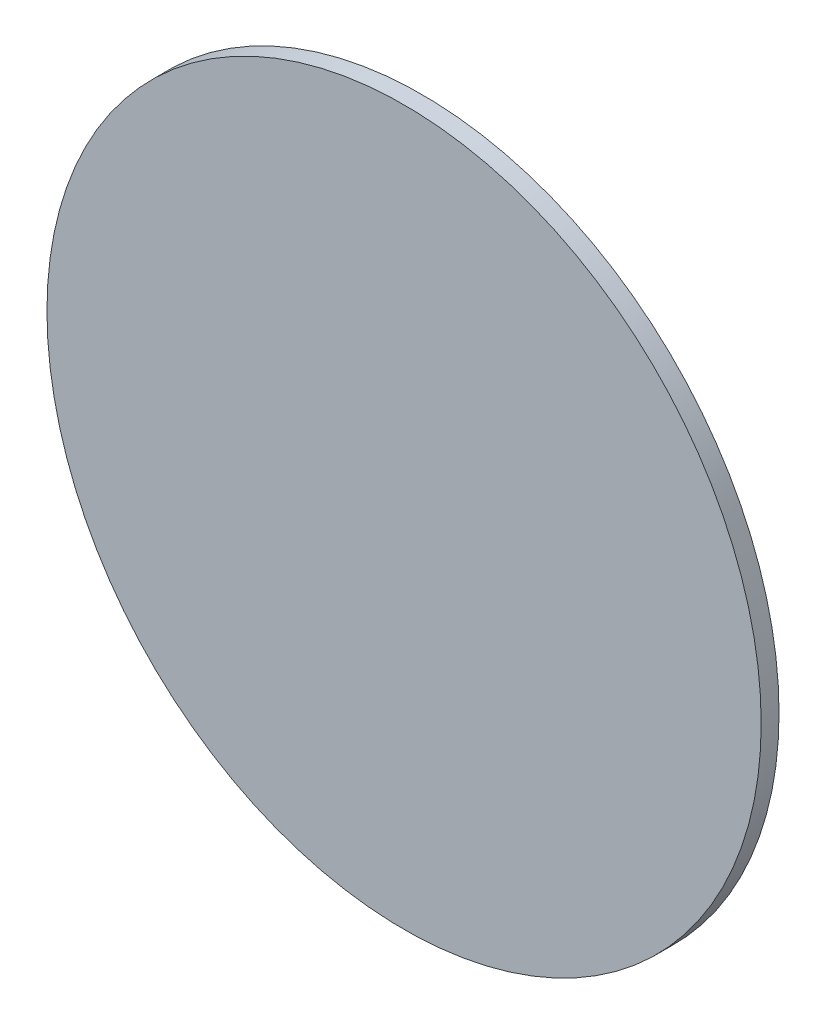
ISO-10303-21;
HEADER;
FILE_DESCRIPTION(('STEP AP214'),'2;1');
FILE_NAME('part.step','',(''),(''),'','','');
FILE_SCHEMA(('AUTOMOTIVE_DESIGN { 1 0 10303 214 1 1 1 1 }'));
ENDSEC;
DATA;
#1=APPLICATION_CONTEXT('core data for automotive mechanical design processes');
#2=APPLICATION_PROTOCOL_DEFINITION('international standard','automotive_design',2000,#1);
#3=PRODUCT_CONTEXT('',#1,'mechanical');
#4=PRODUCT('Part','Part','',(#3));
#5=PRODUCT_RELATED_PRODUCT_CATEGORY('part','',(#4));
#6=PRODUCT_DEFINITION_FORMATION('','',#4);
#7=PRODUCT_DEFINITION_CONTEXT('part definition',#1,'design');
#8=PRODUCT_DEFINITION('design','',#6,#7);
#9=PRODUCT_DEFINITION_SHAPE('','',#8);
#10=(LENGTH_UNIT() NAMED_UNIT(*) SI_UNIT(.MILLI.,.METRE.));
#11=(NAMED_UNIT(*) PLANE_ANGLE_UNIT() SI_UNIT($,.RADIAN.));
#12=(NAMED_UNIT(*) SI_UNIT($,.STERADIAN.) SOLID_ANGLE_UNIT());
#13=UNCERTAINTY_MEASURE_WITH_UNIT(LENGTH_MEASURE(1.E-05),#10,'distance_accuracy_value','');
#14=(GEOMETRIC_REPRESENTATION_CONTEXT(3) GLOBAL_UNCERTAINTY_ASSIGNED_CONTEXT((#13)) GLOBAL_UNIT_ASSIGNED_CONTEXT((#10,
#11,#12)) REPRESENTATION_CONTEXT('',''));
#15=CARTESIAN_POINT('',(0.,0.,0.));
#16=DIRECTION('',(0.,0.,1.));
#17=DIRECTION('',(1.,0.,0.));
#18=AXIS2_PLACEMENT_3D('',#15,#16,#17);
#19=CARTESIAN_POINT('',(0.,0.,3.));
#20=DIRECTION('',(0.,0.,-1.));
#21=DIRECTION('',(-1.,0.,0.));
#22=AXIS2_PLACEMENT_3D('',#19,#20,#21);
#23=CYLINDRICAL_SURFACE('',#22,60.);
#24=CARTESIAN_POINT('',(0.,0.,3.));
#25=DIRECTION('',(0.,0.,1.));
#26=DIRECTION('',(1.,0.,0.));
#27=AXIS2_PLACEMENT_3D('',#24,#25,#26);
#28=CIRCLE('',#27,60.);
#29=CARTESIAN_POINT('',(60.,0.,3.));
#30=VERTEX_POINT('',#29);
#31=EDGE_CURVE('E10',#30,#30,#28,.T.);
#32=ORIENTED_EDGE('',*,*,#31,.F.);
#33=EDGE_LOOP('',(#32));
#34=FACE_BOUND('',#33,.T.);
#35=CARTESIAN_POINT('',(0.,0.,0.));
#36=DIRECTION('',(0.,0.,1.));
#37=DIRECTION('',(1.,0.,0.));
#38=AXIS2_PLACEMENT_3D('',#35,#36,#37);
#39=CIRCLE('',#38,60.);
#40=CARTESIAN_POINT('',(60.,0.,0.));
#41=VERTEX_POINT('',#40);
#42=EDGE_CURVE('E34',#41,#41,#39,.T.);
#43=ORIENTED_EDGE('',*,*,#42,.T.);
#44=EDGE_LOOP('',(#43));
#45=FACE_BOUND('',#44,.T.);
#46=ADVANCED_FACE('F31',(#34,#45),#23,.T.);
#47=CARTESIAN_POINT('',(0.,0.,3.));
#48=DIRECTION('',(0.,0.,1.));
#49=DIRECTION('',(1.,0.,0.));
#50=AXIS2_PLACEMENT_3D('',#47,#48,#49);
#51=PLANE('',#50);
#52=ORIENTED_EDGE('',*,*,#31,.T.);
#53=EDGE_LOOP('',(#52));
#54=FACE_BOUND('',#53,.T.);
#55=ADVANCED_FACE('F46',(#54),#51,.T.);
#56=CARTESIAN_POINT('',(0.,0.,0.));
#57=DIRECTION('',(0.,0.,1.));
#58=DIRECTION('',(1.,0.,0.));
#59=AXIS2_PLACEMENT_3D('',#56,#57,#58);
#60=PLANE('',#59);
#61=ORIENTED_EDGE('',*,*,#42,.F.);
#62=EDGE_LOOP('',(#61));
#63=FACE_BOUND('',#62,.T.);
#64=ADVANCED_FACE('F44',(#63),#60,.F.);
#65=CLOSED_SHELL('',(#46,#55,#64));
#66=MANIFOLD_SOLID_BREP('B2',#65);
#67=ADVANCED_BREP_SHAPE_REPRESENTATION('',(#18,#66),#14);
#68=SHAPE_DEFINITION_REPRESENTATION(#9,#67);
ENDSEC;
END-ISO-10303-21;
